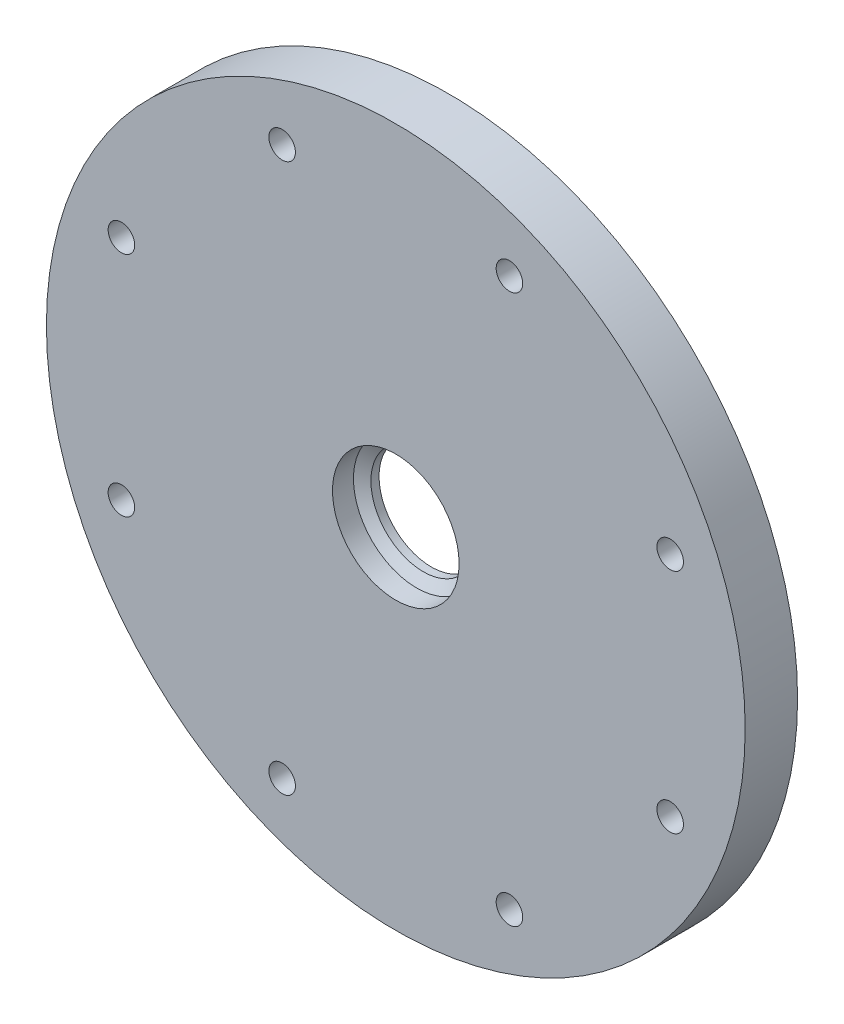
ISO-10303-21;
HEADER;
FILE_DESCRIPTION(('STEP AP214'),'2;1');
FILE_NAME('part.step','',(''),(''),'','','');
FILE_SCHEMA(('AUTOMOTIVE_DESIGN { 1 0 10303 214 1 1 1 1 }'));
ENDSEC;
DATA;
#1=APPLICATION_CONTEXT('core data for automotive mechanical design processes');
#2=APPLICATION_PROTOCOL_DEFINITION('international standard','automotive_design',2000,#1);
#3=PRODUCT_CONTEXT('',#1,'mechanical');
#4=PRODUCT('Part','Part','',(#3));
#5=PRODUCT_RELATED_PRODUCT_CATEGORY('part','',(#4));
#6=PRODUCT_DEFINITION_FORMATION('','',#4);
#7=PRODUCT_DEFINITION_CONTEXT('part definition',#1,'design');
#8=PRODUCT_DEFINITION('design','',#6,#7);
#9=PRODUCT_DEFINITION_SHAPE('','',#8);
#10=(LENGTH_UNIT() NAMED_UNIT(*) SI_UNIT(.MILLI.,.METRE.));
#11=(NAMED_UNIT(*) PLANE_ANGLE_UNIT() SI_UNIT($,.RADIAN.));
#12=(NAMED_UNIT(*) SI_UNIT($,.STERADIAN.) SOLID_ANGLE_UNIT());
#13=UNCERTAINTY_MEASURE_WITH_UNIT(LENGTH_MEASURE(1.E-05),#10,'distance_accuracy_value','');
#14=(GEOMETRIC_REPRESENTATION_CONTEXT(3) GLOBAL_UNCERTAINTY_ASSIGNED_CONTEXT((#13)) GLOBAL_UNIT_ASSIGNED_CONTEXT((#10,
#11,#12)) REPRESENTATION_CONTEXT('',''));
#15=CARTESIAN_POINT('',(0.,0.,0.));
#16=DIRECTION('',(0.,0.,1.));
#17=DIRECTION('',(1.,0.,0.));
#18=AXIS2_PLACEMENT_3D('',#15,#16,#17);
#19=CARTESIAN_POINT('',(0.,0.,9.525));
#20=DIRECTION('',(0.,0.,-1.));
#21=DIRECTION('',(-1.,0.,0.));
#22=AXIS2_PLACEMENT_3D('',#19,#20,#21);
#23=CYLINDRICAL_SURFACE('',#22,9.525);
#24=CARTESIAN_POINT('',(0.,0.,4.5245749415826));
#25=DIRECTION('',(0.,0.,1.));
#26=DIRECTION('',(1.,0.,0.));
#27=AXIS2_PLACEMENT_3D('',#24,#25,#26);
#28=CIRCLE('',#27,9.525);
#29=CARTESIAN_POINT('',(9.525,0.,4.5245749415826));
#30=VERTEX_POINT('',#29);
#31=EDGE_CURVE('E41',#30,#30,#28,.F.);
#32=ORIENTED_EDGE('',*,*,#31,.F.);
#33=EDGE_LOOP('',(#32));
#34=FACE_BOUND('',#33,.T.);
#35=CARTESIAN_POINT('',(0.,0.,3.048));
#36=DIRECTION('',(0.,0.,-1.));
#37=DIRECTION('',(-1.,0.,0.));
#38=AXIS2_PLACEMENT_3D('',#35,#36,#37);
#39=CIRCLE('',#38,9.525);
#40=CARTESIAN_POINT('',(-9.525,0.,3.048));
#41=VERTEX_POINT('',#40);
#42=EDGE_CURVE('E181',#41,#41,#39,.T.);
#43=ORIENTED_EDGE('',*,*,#42,.T.);
#44=EDGE_LOOP('',(#43));
#45=FACE_BOUND('',#44,.T.);
#46=ADVANCED_FACE('F38',(#34,#45),#23,.F.);
#47=CARTESIAN_POINT('',(0.,0.,9.525));
#48=DIRECTION('',(0.,0.,-1.));
#49=DIRECTION('',(-1.,0.,0.));
#50=AXIS2_PLACEMENT_3D('',#47,#48,#49);
#51=CYLINDRICAL_SURFACE('',#50,63.5);
#52=CARTESIAN_POINT('',(0.,0.,9.525));
#53=DIRECTION('',(0.,0.,1.));
#54=DIRECTION('',(1.,0.,0.));
#55=AXIS2_PLACEMENT_3D('',#52,#53,#54);
#56=CIRCLE('',#55,63.5);
#57=CARTESIAN_POINT('',(63.5,0.,9.525));
#58=VERTEX_POINT('',#57);
#59=EDGE_CURVE('E11',#58,#58,#56,.T.);
#60=ORIENTED_EDGE('',*,*,#59,.F.);
#61=EDGE_LOOP('',(#60));
#62=FACE_BOUND('',#61,.T.);
#63=CARTESIAN_POINT('',(0.,0.,0.));
#64=DIRECTION('',(0.,0.,1.));
#65=DIRECTION('',(1.,0.,0.));
#66=AXIS2_PLACEMENT_3D('',#63,#64,#65);
#67=CIRCLE('',#66,63.5);
#68=CARTESIAN_POINT('',(63.5,0.,0.));
#69=VERTEX_POINT('',#68);
#70=EDGE_CURVE('E46',#69,#69,#67,.T.);
#71=ORIENTED_EDGE('',*,*,#70,.T.);
#72=EDGE_LOOP('',(#71));
#73=FACE_BOUND('',#72,.T.);
#74=ADVANCED_FACE('F160',(#62,#73),#51,.T.);
#75=CARTESIAN_POINT('',(0.,0.,9.525));
#76=DIRECTION('',(0.,0.,1.));
#77=DIRECTION('',(1.,0.,0.));
#78=AXIS2_PLACEMENT_3D('',#75,#76,#77);
#79=PLANE('',#78);
#80=CARTESIAN_POINT('',(0.,0.,9.525));
#81=DIRECTION('',(0.,0.,1.));
#82=DIRECTION('',(1.,0.,0.));
#83=AXIS2_PLACEMENT_3D('',#80,#81,#82);
#84=CIRCLE('',#83,11.5062);
#85=CARTESIAN_POINT('',(11.5062,0.,9.525));
#86=VERTEX_POINT('',#85);
#87=EDGE_CURVE('E198',#86,#86,#84,.T.);
#88=ORIENTED_EDGE('',*,*,#87,.F.);
#89=EDGE_LOOP('',(#88));
#90=FACE_BOUND('',#89,.T.);
#91=CARTESIAN_POINT('',(49.866397767297,-20.6553382619051,9.525));
#92=DIRECTION('',(0.,0.,1.));
#93=DIRECTION('',(0.707106781186556,-0.707106781186539,0.));
#94=AXIS2_PLACEMENT_3D('',#91,#92,#93);
#95=CIRCLE('',#94,2.413);
#96=CARTESIAN_POINT('',(51.5726464303001,-22.3615869249082,9.525));
#97=VERTEX_POINT('',#96);
#98=EDGE_CURVE('E207',#97,#97,#95,.T.);
#99=ORIENTED_EDGE('',*,*,#98,.F.);
#100=EDGE_LOOP('',(#99));
#101=FACE_BOUND('',#100,.T.);
#102=CARTESIAN_POINT('',(20.6553382619063,-49.8663977672965,9.525));
#103=DIRECTION('',(0.,0.,1.));
#104=DIRECTION('',(0.,-1.,0.));
#105=AXIS2_PLACEMENT_3D('',#102,#103,#104);
#106=CIRCLE('',#105,2.413);
#107=CARTESIAN_POINT('',(20.6553382619063,-52.2793977672965,9.525));
#108=VERTEX_POINT('',#107);
#109=EDGE_CURVE('E211',#108,#108,#106,.T.);
#110=ORIENTED_EDGE('',*,*,#109,.F.);
#111=EDGE_LOOP('',(#110));
#112=FACE_BOUND('',#111,.T.);
#113=CARTESIAN_POINT('',(-20.6553382619053,-49.8663977672969,9.525));
#114=DIRECTION('',(0.,0.,1.));
#115=DIRECTION('',(-0.707106781186541,-0.707106781186554,0.));
#116=AXIS2_PLACEMENT_3D('',#113,#114,#115);
#117=CIRCLE('',#116,2.413);
#118=CARTESIAN_POINT('',(-22.3615869249084,-51.5726464303,9.525));
#119=VERTEX_POINT('',#118);
#120=EDGE_CURVE('E215',#119,#119,#117,.T.);
#121=ORIENTED_EDGE('',*,*,#120,.F.);
#122=EDGE_LOOP('',(#121));
#123=FACE_BOUND('',#122,.T.);
#124=CARTESIAN_POINT('',(-49.8663977672967,-20.6553382619058,9.525));
#125=DIRECTION('',(0.,0.,1.));
#126=DIRECTION('',(-1.,0.,0.));
#127=AXIS2_PLACEMENT_3D('',#124,#125,#126);
#128=CIRCLE('',#127,2.413);
#129=CARTESIAN_POINT('',(-52.2793977672967,-20.6553382619058,9.525));
#130=VERTEX_POINT('',#129);
#131=EDGE_CURVE('E219',#130,#130,#128,.T.);
#132=ORIENTED_EDGE('',*,*,#131,.F.);
#133=EDGE_LOOP('',(#132));
#134=FACE_BOUND('',#133,.T.);
#135=CARTESIAN_POINT('',(-49.8663977672968,20.6553382619054,9.525));
#136=DIRECTION('',(0.,0.,1.));
#137=DIRECTION('',(-0.707106781186551,0.707106781186544,0.));
#138=AXIS2_PLACEMENT_3D('',#135,#136,#137);
#139=CIRCLE('',#138,2.413);
#140=CARTESIAN_POINT('',(-51.5726464303,22.3615869249086,9.525));
#141=VERTEX_POINT('',#140);
#142=EDGE_CURVE('E223',#141,#141,#139,.T.);
#143=ORIENTED_EDGE('',*,*,#142,.F.);
#144=EDGE_LOOP('',(#143));
#145=FACE_BOUND('',#144,.T.);
#146=CARTESIAN_POINT('',(-20.6553382619059,49.8663977672966,9.525));
#147=DIRECTION('',(0.,0.,1.));
#148=DIRECTION('',(0.,1.,0.));
#149=AXIS2_PLACEMENT_3D('',#146,#147,#148);
#150=CIRCLE('',#149,2.413);
#151=CARTESIAN_POINT('',(-20.6553382619059,52.2793977672966,9.525));
#152=VERTEX_POINT('',#151);
#153=EDGE_CURVE('E227',#152,#152,#150,.T.);
#154=ORIENTED_EDGE('',*,*,#153,.F.);
#155=EDGE_LOOP('',(#154));
#156=FACE_BOUND('',#155,.T.);
#157=CARTESIAN_POINT('',(20.6553382619056,49.8663977672968,9.525));
#158=DIRECTION('',(0.,0.,1.));
#159=DIRECTION('',(0.707106781186546,0.707106781186549,0.));
#160=AXIS2_PLACEMENT_3D('',#157,#158,#159);
#161=CIRCLE('',#160,2.413);
#162=CARTESIAN_POINT('',(22.3615869249087,51.5726464302999,9.525));
#163=VERTEX_POINT('',#162);
#164=EDGE_CURVE('E231',#163,#163,#161,.T.);
#165=ORIENTED_EDGE('',*,*,#164,.F.);
#166=EDGE_LOOP('',(#165));
#167=FACE_BOUND('',#166,.T.);
#168=CARTESIAN_POINT('',(49.8663977672967,20.6553382619058,9.525));
#169=DIRECTION('',(0.,0.,1.));
#170=DIRECTION('',(1.,0.,0.));
#171=AXIS2_PLACEMENT_3D('',#168,#169,#170);
#172=CIRCLE('',#171,2.413);
#173=CARTESIAN_POINT('',(52.2793977672967,20.6553382619058,9.525));
#174=VERTEX_POINT('',#173);
#175=EDGE_CURVE('E178',#174,#174,#172,.T.);
#176=ORIENTED_EDGE('',*,*,#175,.F.);
#177=EDGE_LOOP('',(#176));
#178=FACE_BOUND('',#177,.T.);
#179=ORIENTED_EDGE('',*,*,#59,.T.);
#180=EDGE_LOOP('',(#179));
#181=FACE_BOUND('',#180,.T.);
#182=ADVANCED_FACE('F157',(#90,#101,#112,#123,#134,#145,#156,#167,#178,#181),#79,.T.);
#183=CARTESIAN_POINT('',(0.,0.,0.));
#184=DIRECTION('',(0.,0.,1.));
#185=DIRECTION('',(1.,0.,0.));
#186=AXIS2_PLACEMENT_3D('',#183,#184,#185);
#187=PLANE('',#186);
#188=DIRECTION('',(-1.,0.,0.));
#189=VECTOR('',#188,1.);
#190=CARTESIAN_POINT('',(0.,3.30820588766945,0.));
#191=LINE('',#190,#189);
#192=CARTESIAN_POINT('',(41.7265377302756,3.30820588766945,0.));
#193=VERTEX_POINT('',#192);
#194=CARTESIAN_POINT('',(38.3776456322172,3.30820588766945,0.));
#195=VERTEX_POINT('',#194);
#196=EDGE_CURVE('E104',#193,#195,#191,.T.);
#197=ORIENTED_EDGE('',*,*,#196,.T.);
#198=CARTESIAN_POINT('',(38.3776456322171,7.88179807913385,0.));
#199=DIRECTION('',(0.,0.,1.));
#200=DIRECTION('',(1.,0.,0.));
#201=AXIS2_PLACEMENT_3D('',#198,#199,#200);
#202=CIRCLE('',#201,4.57359219146441);
#203=CARTESIAN_POINT('',(33.8651421831309,7.13677582724513,0.));
#204=VERTEX_POINT('',#203);
#205=EDGE_CURVE('E183',#195,#204,#202,.F.);
#206=ORIENTED_EDGE('',*,*,#205,.T.);
#207=CARTESIAN_POINT('',(34.2958656322172,0.,0.));
#208=CARTESIAN_POINT('',(34.2988283398987,0.0719164356410514,0.));
#209=CARTESIAN_POINT('',(34.3047545772634,0.215769260101811,0.));
#210=CARTESIAN_POINT('',(34.3119668879308,0.431642323746638,0.));
#211=CARTESIAN_POINT('',(34.3179347547378,0.647612083143586,0.));
#212=CARTESIAN_POINT('',(34.3271399883812,1.07991711399044,0.));
#213=CARTESIAN_POINT('',(34.3329421657517,2.09030657601597,0.));
#214=CARTESIAN_POINT('',(34.2798982254852,3.60736205399581,0.));
#215=CARTESIAN_POINT('',(34.1204451546237,5.41030124969768,0.));
#216=CARTESIAN_POINT('',(33.8801694761154,7.13532662840969,0.));
#217=CARTESIAN_POINT('',(33.5528859624341,8.8499256844614,0.));
#218=CARTESIAN_POINT('',(33.1389978044588,10.5497094295948,0.));
#219=CARTESIAN_POINT('',(32.6391403513611,12.2303025190622,0.));
#220=CARTESIAN_POINT('',(32.0541748945098,13.887355712914,0.));
#221=CARTESIAN_POINT('',(31.3851870558513,15.5165575032151,0.));
#222=CARTESIAN_POINT('',(30.6334836447529,17.113645750915,0.));
#223=CARTESIAN_POINT('',(29.8005899514624,18.6744190548477,0.));
#224=CARTESIAN_POINT('',(28.8882464002713,20.1947479877455,0.));
#225=CARTESIAN_POINT('',(27.8984048753274,21.6705861384519,0.));
#226=CARTESIAN_POINT('',(26.8332245214539,23.0979809668407,0.));
#227=CARTESIAN_POINT('',(25.6950670671234,24.4730844426948,0.));
#228=CARTESIAN_POINT('',(24.4864916349468,25.7921634500981,0.));
#229=CARTESIAN_POINT('',(23.2102490508359,27.0516099322624,0.));
#230=CARTESIAN_POINT('',(21.8692756520975,28.2479507532477,0.));
#231=CARTESIAN_POINT('',(20.4666866048744,29.3778572518646,0.));
#232=CARTESIAN_POINT('',(19.0057687415094,30.43815446357,0.));
#233=CARTESIAN_POINT('',(17.4899729317966,31.425829986316,0.));
#234=CARTESIAN_POINT('',(15.9229060035758,32.3380424668578,0.));
#235=CARTESIAN_POINT('',(14.3083222300884,33.172129684753,0.));
#236=CARTESIAN_POINT('',(12.6501144028526,33.9256162118566,0.));
#237=CARTESIAN_POINT('',(10.9523045104309,34.5962206262852,0.));
#238=CARTESIAN_POINT('',(9.2190340445245,35.1818622604019,0.));
#239=CARTESIAN_POINT('',(7.45455395624005,35.6806674637987,0.));
#240=CARTESIAN_POINT('',(5.663214286303,36.0909753630028,0.));
#241=CARTESIAN_POINT('',(3.84945349415193,36.4113431010872,0.));
#242=CARTESIAN_POINT('',(2.0177875117066,36.6405505413982,0.));
#243=CARTESIAN_POINT('',(0.172798548525801,36.777604420956,0.));
#244=CARTESIAN_POINT('',(-1.68087632413851,36.8217419404773,0.));
#245=CARTESIAN_POINT('',(-3.53855678217463,36.7724337792443,0.));
#246=CARTESIAN_POINT('',(-5.395531021451,36.6293865244745,0.));
#247=CARTESIAN_POINT('',(-7.24706766521656,36.3925445063906,0.));
#248=CARTESIAN_POINT('',(-9.08842777610979,36.0620910314903,0.));
#249=CARTESIAN_POINT('',(-10.9148769424333,35.638449008293,0.));
#250=CARTESIAN_POINT('',(-12.7216974079583,35.1222809610018,0.));
#251=CARTESIAN_POINT('',(-14.504200214338,34.5144884285037,0.));
#252=CARTESIAN_POINT('',(-16.2577373249457,33.8162107472913,0.));
#253=CARTESIAN_POINT('',(-17.9777136989338,33.0288232187894,0.));
#254=CARTESIAN_POINT('',(-19.6595992842238,32.1539346629252,0.));
#255=CARTESIAN_POINT('',(-21.2989408982579,31.1933843615357,0.));
#256=CARTESIAN_POINT('',(-22.8913739654388,30.1492383966572,0.));
#257=CARTESIAN_POINT('',(-24.4326340804494,29.0237853904367,0.));
#258=CARTESIAN_POINT('',(-25.9185683669347,27.8195316549019,0.));
#259=CARTESIAN_POINT('',(-27.3451466014136,26.5391957614133,0.));
#260=CARTESIAN_POINT('',(-28.7084720727539,25.1857025411449,0.));
#261=CARTESIAN_POINT('',(-30.0047921481285,23.7621765294992,0.));
#262=CARTESIAN_POINT('',(-31.230508516913,22.2719348687727,0.));
#263=CARTESIAN_POINT('',(-32.3821870848105,20.7184796849594,0.));
#264=CARTESIAN_POINT('',(-33.4565674911139,19.1054899558742,0.));
#265=CARTESIAN_POINT('',(-34.4505722230281,17.4368128893039,0.));
#266=CARTESIAN_POINT('',(-35.361315301739,15.7164548311081,0.));
#267=CARTESIAN_POINT('',(-36.1861105160575,13.9485717246141,0.));
#268=CARTESIAN_POINT('',(-36.9224791803928,12.1374591437956,0.));
#269=CARTESIAN_POINT('',(-37.5681573950165,10.2875419239972,0.));
#270=CARTESIAN_POINT('',(-38.1211027877574,8.40336341507815,0.));
#271=CARTESIAN_POINT('',(-38.579500717431,6.48957438292442,0.));
#272=CARTESIAN_POINT('',(-38.9417699207588,4.55092158633372,0.));
#273=CARTESIAN_POINT('',(-39.2065675857196,2.59223605718916,0.));
#274=CARTESIAN_POINT('',(-39.3727938357768,0.618421112757694,0.));
#275=CARTESIAN_POINT('',(-39.4395956108992,-1.36555987023922,0.));
#276=CARTESIAN_POINT('',(-39.406369932679,-3.35469588940579,0.));
#277=CARTESIAN_POINT('',(-39.2727665424726,-5.34394092724165,0.));
#278=CARTESIAN_POINT('',(-39.0386899030474,-7.32822670685141,0.));
#279=CARTESIAN_POINT('',(-38.7043005557691,-9.30247556063955,0.));
#280=CARTESIAN_POINT('',(-38.2700158270333,-11.2616133793943,0.));
#281=CARTESIAN_POINT('',(-37.7365098792967,-13.2005826088241,0.));
#282=CARTESIAN_POINT('',(-37.1047131036853,-15.1143552603352,0.));
#283=CARTESIAN_POINT('',(-36.3758108529087,-16.9979459026719,0.));
#284=CARTESIAN_POINT('',(-35.5512415148377,-18.846424600921,0.));
#285=CARTESIAN_POINT('',(-34.6326939288693,-20.6549297694151,0.));
#286=CARTESIAN_POINT('',(-33.6221041488316,-22.4186809050873,0.));
#287=CARTESIAN_POINT('',(-32.5216515579523,-24.1329911680554,0.));
#288=CARTESIAN_POINT('',(-31.333754343067,-25.793279776417,0.));
#289=CARTESIAN_POINT('',(-30.0610643369273,-27.395084182599,0.));
#290=CARTESIAN_POINT('',(-28.7064612391545,-28.9340719990193,0.));
#291=CARTESIAN_POINT('',(-27.2730462280158,-30.4060526413252,0.));
#292=CARTESIAN_POINT('',(-25.7641349768275,-31.8069886580736,0.));
#293=CARTESIAN_POINT('',(-24.1832500903733,-33.1330067163735,0.));
#294=CARTESIAN_POINT('',(-22.5341129783108,-34.3804082137974,0.));
#295=CARTESIAN_POINT('',(-20.820635184016,-35.5456794876579,0.));
#296=CARTESIAN_POINT('',(-19.0469091888745,-36.6255015937423,0.));
#297=CARTESIAN_POINT('',(-17.2171987133532,-37.616759627458,0.));
#298=CARTESIAN_POINT('',(-15.3359285377066,-38.5165515615768,0.));
#299=CARTESIAN_POINT('',(-13.4076738663693,-39.3221965757118,0.));
#300=CARTESIAN_POINT('',(-11.4371492614876,-40.0312428540429,0.));
#301=CARTESIAN_POINT('',(-9.42919717216959,-40.6414748289538,0.));
#302=CARTESIAN_POINT('',(-7.38877608722696,-41.1509198496055,0.));
#303=CARTESIAN_POINT('',(-5.32094834028347,-41.5578542559499,0.));
#304=CARTESIAN_POINT('',(-3.23086759708489,-41.8608088399455,0.));
#305=CARTESIAN_POINT('',(-1.12376605586641,-42.058573677502,0.));
#306=CARTESIAN_POINT('',(0.995058607571763,-42.1502023159327,0.));
#307=CARTESIAN_POINT('',(3.1202565175867,-42.1350153036167,0.));
#308=CARTESIAN_POINT('',(5.24643906603381,-42.012603049844,0.));
#309=CARTESIAN_POINT('',(7.36819253542281,-41.7828280049013,0.));
#310=CARTESIAN_POINT('',(9.48009184352148,-41.4458261517547,0.));
#311=CARTESIAN_POINT('',(11.5767143746119,-41.0020078027653,0.));
#312=CARTESIAN_POINT('',(13.6526538622118,-40.4520576963991,0.));
#313=CARTESIAN_POINT('',(15.7025342878154,-39.7969343908391,0.));
#314=CARTESIAN_POINT('',(17.7210237599909,-39.0378689530399,0.));
#315=CARTESIAN_POINT('',(19.7028483381266,-38.1763629437867,0.));
#316=CARTESIAN_POINT('',(21.6428057650362,-37.2141857008853,0.));
#317=CARTESIAN_POINT('',(23.5357790728052,-36.153370924662,0.));
#318=CARTESIAN_POINT('',(25.376750026369,-34.9962125715943,0.));
#319=CARTESIAN_POINT('',(27.1608123696351,-33.7452600637943,0.));
#320=CARTESIAN_POINT('',(28.8831848392854,-32.4033128238131,0.));
#321=CARTESIAN_POINT('',(30.5392239118853,-30.9734141460373,0.));
#322=CARTESIAN_POINT('',(32.1244362504616,-29.458844417699,0.));
#323=CARTESIAN_POINT('',(33.6344908172952,-27.8631137042031,0.));
#324=CARTESIAN_POINT('',(35.0652306205303,-26.1899537152836,0.));
#325=CARTESIAN_POINT('',(36.4126840628171,-24.4433091700016,0.));
#326=CARTESIAN_POINT('',(37.6730758613159,-22.6273285803872,0.));
#327=CARTESIAN_POINT('',(38.8428375091632,-20.7463544749617,0.));
#328=CARTESIAN_POINT('',(39.9186172497505,-18.8049130850149,0.));
#329=CARTESIAN_POINT('',(40.897289536131,-16.8077035179059,0.));
#330=CARTESIAN_POINT('',(41.7759639492164,-14.7595864431264,0.));
#331=CARTESIAN_POINT('',(42.5519935496357,-12.6655723182052,0.));
#332=CARTESIAN_POINT('',(43.2229826395127,-10.5308091828219,0.));
#333=CARTESIAN_POINT('',(43.7867939118442,-8.36057005073488,0.));
#334=CARTESIAN_POINT('',(44.2415549666095,-6.1602399302733,0.));
#335=CARTESIAN_POINT('',(44.5712845422953,-4.02827816749163,0.));
#336=CARTESIAN_POINT('',(44.7405602674272,-2.44084571238201,0.));
#337=CARTESIAN_POINT('',(44.8137280393605,-1.50376068035805,0.));
#338=CARTESIAN_POINT('',(44.8394775213742,-1.12829322602927,0.));
#339=CARTESIAN_POINT('',(44.8570322264384,-0.84647024133921,0.));
#340=CARTESIAN_POINT('',(44.8727821790452,-0.564469794978507,0.));
#341=CARTESIAN_POINT('',(44.8868875760611,-0.282309502735571,0.));
#342=CARTESIAN_POINT('',(44.8947903255209,-0.094111086056059,0.));
#343=CARTESIAN_POINT('',(44.8987421990149,0.,0.));
#344=B_SPLINE_CURVE_WITH_KNOTS('',3,(#207,#208,#209,#210,#211,#212,#213,#214,#215,#216,#217,
#218,#219,#220,#221,#222,#223,#224,#225,#226,#227,#228,#229,#230,#231,#232,#233,#234,#235,#236,
#237,#238,#239,#240,#241,#242,#243,#244,#245,#246,#247,#248,#249,#250,#251,#252,#253,#254,#255,
#256,#257,#258,#259,#260,#261,#262,#263,#264,#265,#266,#267,#268,#269,#270,#271,#272,#273,#274,
#275,#276,#277,#278,#279,#280,#281,#282,#283,#284,#285,#286,#287,#288,#289,#290,#291,#292,#293,
#294,#295,#296,#297,#298,#299,#300,#301,#302,#303,#304,#305,#306,#307,#308,#309,#310,#311,#312,
#313,#314,#315,#316,#317,#318,#319,#320,#321,#322,#323,#324,#325,#326,#327,#328,#329,#330,#331,
#332,#333,#334,#335,#336,#337,#338,#339,#340,#341,#342,#343),.UNSPECIFIED.,.F.,.F.,(4,1,1,1,1,1,
1,1,1,1,1,1,1,1,1,1,1,1,1,1,1,1,1,1,1,1,1,1,1,1,1,1,1,1,1,1,1,1,1,1,1,1,1,1,1,1,1,1,1,1,1,1,1,1,
1,1,1,1,1,1,1,1,1,1,1,1,1,1,1,1,1,1,1,1,1,1,1,1,1,1,1,1,1,1,1,1,1,1,1,1,1,1,1,1,1,1,1,1,1,1,1,1,
1,1,1,1,1,1,1,1,1,1,1,1,1,1,1,1,1,1,1,1,1,1,1,1,1,1,1,1,1,1,1,1,4),(0.,0.000870247599430737,
0.00174073664861733,0.00261146583389978,0.00348243493817679,0.00696871163036565,
0.0148269159676711,0.0218284300658471,0.0288454978901986,0.0358781861529964,0.0429265557930998,
0.0499906632180707,0.0570705611878874,0.0641662994541098,0.071277925235676,0.0784054835829576,
0.0855490176630983,0.0927085689883016,0.0998841776017372,0.107075882231238,0.11428372041806,
0.121507728626011,0.128747942334863,0.13600439612105,0.143277123727941,0.150566158127471,
0.157871531574549,0.165193275655374,0.172531421330565,0.179885998973864,0.187257038407004,
0.194644568931274,0.202048619356179,0.209469218025581,0.216906392841596,0.224360171286527,
0.231830580443038,0.239317647012768,0.246821397333545,0.254341857395345,0.261879052855118,
0.269433009050593,0.277003751013156,0.284591303479885,0.292195690904824,0.299816937469546,
0.307455067093091,0.315110103441297,0.32278206993561,0.330470989761382,0.33817688587572,
0.345899781014901,0.353639697701409,0.361396658250587,0.369170684776971,0.376961799200297,
0.384770023251215,0.392595378476738,0.400437886245424,0.408297567752328,0.41617444402372,
0.424068535921609,0.431979864148049,0.439908449249276,0.447854311619665,0.455817471505519,
0.463797949008711,0.47179576409017,0.479810936573239,0.487843486146895,0.495893432368847,
0.503960794668521,0.512045592349928,0.520147844594431,0.528267570463411,0.536404788900837,
0.544559518735747,0.552731778684641,0.560921587353796,0.5691289632415,0.57735392474021,
0.585596490138645,0.593856677623807,0.602134505282936,0.610429991105407,0.618743152984567,
0.627074008719514,0.635422576016818,0.643788872492204,0.652172915672168,0.660574722995556,
0.668994311815095,0.677431699398876,0.685886902931806,0.694359939517004,0.702850826177169,
0.711359579855908,0.719886217419028,0.72843075565579,0.736993211280136,0.745573600931878,
0.754171941177858,0.76278824851308,0.771422539361813,0.780074830078659,0.788745136949606,
0.797433476193047,0.806139863960776,0.814864316338961,0.823606849349089,0.8323674789489,
0.84114622103328,0.849943091435156,0.858758105926351,0.867591280218428,0.876442629963517,
0.885312170755117,0.894199918128888,0.903105887563412,0.912030094480956,0.920972554248204,
0.929933282176977,0.938912293524941,0.947909603496297,0.956925227242455,0.965959179862699,
0.975011476404832,0.984082131865813,0.992034027196134,0.99430858251311,0.99544629118736,
0.996584287244162,0.997722570712535,0.998861141621482,1.),.UNSPECIFIED.);
#345=CARTESIAN_POINT('',(44.8987421990149,0.,0.));
#346=VERTEX_POINT('',#345);
#347=EDGE_CURVE('E188',#204,#346,#344,.T.);
#348=ORIENTED_EDGE('',*,*,#347,.T.);
#349=CARTESIAN_POINT('',(41.7265377302756,0.133205887669454,0.));
#350=DIRECTION('',(0.,0.,1.));
#351=DIRECTION('',(1.,0.,0.));
#352=AXIS2_PLACEMENT_3D('',#349,#350,#351);
#353=CIRCLE('',#352,3.175);
#354=EDGE_CURVE('E54',#346,#193,#353,.T.);
#355=ORIENTED_EDGE('',*,*,#354,.T.);
#356=EDGE_LOOP('',(#197,#206,#348,#355));
#357=FACE_BOUND('',#356,.T.);
#358=CARTESIAN_POINT('',(49.866397767297,-20.6553382619051,0.));
#359=DIRECTION('',(0.,0.,1.));
#360=DIRECTION('',(0.707106781186556,-0.707106781186539,0.));
#361=AXIS2_PLACEMENT_3D('',#358,#359,#360);
#362=CIRCLE('',#361,2.413);
#363=CARTESIAN_POINT('',(51.5726464303001,-22.3615869249082,0.));
#364=VERTEX_POINT('',#363);
#365=EDGE_CURVE('E243',#364,#364,#362,.T.);
#366=ORIENTED_EDGE('',*,*,#365,.T.);
#367=EDGE_LOOP('',(#366));
#368=FACE_BOUND('',#367,.T.);
#369=CARTESIAN_POINT('',(20.6553382619063,-49.8663977672965,0.));
#370=DIRECTION('',(0.,0.,1.));
#371=DIRECTION('',(0.,-1.,0.));
#372=AXIS2_PLACEMENT_3D('',#369,#370,#371);
#373=CIRCLE('',#372,2.413);
#374=CARTESIAN_POINT('',(20.6553382619063,-52.2793977672965,0.));
#375=VERTEX_POINT('',#374);
#376=EDGE_CURVE('E247',#375,#375,#373,.T.);
#377=ORIENTED_EDGE('',*,*,#376,.T.);
#378=EDGE_LOOP('',(#377));
#379=FACE_BOUND('',#378,.T.);
#380=CARTESIAN_POINT('',(-20.6553382619053,-49.8663977672969,0.));
#381=DIRECTION('',(0.,0.,1.));
#382=DIRECTION('',(-0.707106781186541,-0.707106781186554,0.));
#383=AXIS2_PLACEMENT_3D('',#380,#381,#382);
#384=CIRCLE('',#383,2.413);
#385=CARTESIAN_POINT('',(-22.3615869249084,-51.5726464303,0.));
#386=VERTEX_POINT('',#385);
#387=EDGE_CURVE('E251',#386,#386,#384,.T.);
#388=ORIENTED_EDGE('',*,*,#387,.T.);
#389=EDGE_LOOP('',(#388));
#390=FACE_BOUND('',#389,.T.);
#391=CARTESIAN_POINT('',(-49.8663977672967,-20.6553382619058,0.));
#392=DIRECTION('',(0.,0.,1.));
#393=DIRECTION('',(-1.,0.,0.));
#394=AXIS2_PLACEMENT_3D('',#391,#392,#393);
#395=CIRCLE('',#394,2.413);
#396=CARTESIAN_POINT('',(-52.2793977672967,-20.6553382619058,0.));
#397=VERTEX_POINT('',#396);
#398=EDGE_CURVE('E255',#397,#397,#395,.T.);
#399=ORIENTED_EDGE('',*,*,#398,.T.);
#400=EDGE_LOOP('',(#399));
#401=FACE_BOUND('',#400,.T.);
#402=CARTESIAN_POINT('',(-49.8663977672968,20.6553382619054,0.));
#403=DIRECTION('',(0.,0.,1.));
#404=DIRECTION('',(-0.707106781186551,0.707106781186544,0.));
#405=AXIS2_PLACEMENT_3D('',#402,#403,#404);
#406=CIRCLE('',#405,2.413);
#407=CARTESIAN_POINT('',(-51.5726464303,22.3615869249086,0.));
#408=VERTEX_POINT('',#407);
#409=EDGE_CURVE('E259',#408,#408,#406,.T.);
#410=ORIENTED_EDGE('',*,*,#409,.T.);
#411=EDGE_LOOP('',(#410));
#412=FACE_BOUND('',#411,.T.);
#413=CARTESIAN_POINT('',(-20.6553382619059,49.8663977672966,0.));
#414=DIRECTION('',(0.,0.,1.));
#415=DIRECTION('',(0.,1.,0.));
#416=AXIS2_PLACEMENT_3D('',#413,#414,#415);
#417=CIRCLE('',#416,2.413);
#418=CARTESIAN_POINT('',(-20.6553382619059,52.2793977672966,0.));
#419=VERTEX_POINT('',#418);
#420=EDGE_CURVE('E240',#419,#419,#417,.T.);
#421=ORIENTED_EDGE('',*,*,#420,.T.);
#422=EDGE_LOOP('',(#421));
#423=FACE_BOUND('',#422,.T.);
#424=CARTESIAN_POINT('',(20.6553382619056,49.8663977672968,0.));
#425=DIRECTION('',(0.,0.,1.));
#426=DIRECTION('',(0.707106781186546,0.707106781186549,0.));
#427=AXIS2_PLACEMENT_3D('',#424,#425,#426);
#428=CIRCLE('',#427,2.413);
#429=CARTESIAN_POINT('',(22.3615869249087,51.5726464302999,0.));
#430=VERTEX_POINT('',#429);
#431=EDGE_CURVE('E236',#430,#430,#428,.T.);
#432=ORIENTED_EDGE('',*,*,#431,.T.);
#433=EDGE_LOOP('',(#432));
#434=FACE_BOUND('',#433,.T.);
#435=CARTESIAN_POINT('',(49.8663977672967,20.6553382619058,0.));
#436=DIRECTION('',(0.,0.,1.));
#437=DIRECTION('',(1.,0.,0.));
#438=AXIS2_PLACEMENT_3D('',#435,#436,#437);
#439=CIRCLE('',#438,2.413);
#440=CARTESIAN_POINT('',(52.2793977672967,20.6553382619058,0.));
#441=VERTEX_POINT('',#440);
#442=EDGE_CURVE('E175',#441,#441,#439,.T.);
#443=ORIENTED_EDGE('',*,*,#442,.T.);
#444=EDGE_LOOP('',(#443));
#445=FACE_BOUND('',#444,.T.);
#446=ORIENTED_EDGE('',*,*,#70,.F.);
#447=EDGE_LOOP('',(#446));
#448=FACE_BOUND('',#447,.T.);
#449=ADVANCED_FACE('F155',(#357,#368,#379,#390,#401,#412,#423,#434,#445,#448),#187,.F.);
#450=CARTESIAN_POINT('',(49.8663977672967,20.6553382619058,0.));
#451=DIRECTION('',(0.,0.,1.));
#452=DIRECTION('',(1.,0.,0.));
#453=AXIS2_PLACEMENT_3D('',#450,#451,#452);
#454=CYLINDRICAL_SURFACE('',#453,2.413);
#455=ORIENTED_EDGE('',*,*,#442,.F.);
#456=EDGE_LOOP('',(#455));
#457=FACE_BOUND('',#456,.T.);
#458=ORIENTED_EDGE('',*,*,#175,.T.);
#459=EDGE_LOOP('',(#458));
#460=FACE_BOUND('',#459,.T.);
#461=ADVANCED_FACE('F151',(#457,#460),#454,.F.);
#462=CARTESIAN_POINT('',(20.6553382619056,49.8663977672968,0.));
#463=DIRECTION('',(0.,0.,1.));
#464=DIRECTION('',(1.,0.,0.));
#465=AXIS2_PLACEMENT_3D('',#462,#463,#464);
#466=CYLINDRICAL_SURFACE('',#465,2.413);
#467=ORIENTED_EDGE('',*,*,#431,.F.);
#468=EDGE_LOOP('',(#467));
#469=FACE_BOUND('',#468,.T.);
#470=ORIENTED_EDGE('',*,*,#164,.T.);
#471=EDGE_LOOP('',(#470));
#472=FACE_BOUND('',#471,.T.);
#473=ADVANCED_FACE('F129',(#469,#472),#466,.F.);
#474=CARTESIAN_POINT('',(-20.6553382619059,49.8663977672966,0.));
#475=DIRECTION('',(0.,0.,1.));
#476=DIRECTION('',(1.,0.,0.));
#477=AXIS2_PLACEMENT_3D('',#474,#475,#476);
#478=CYLINDRICAL_SURFACE('',#477,2.413);
#479=ORIENTED_EDGE('',*,*,#420,.F.);
#480=EDGE_LOOP('',(#479));
#481=FACE_BOUND('',#480,.T.);
#482=ORIENTED_EDGE('',*,*,#153,.T.);
#483=EDGE_LOOP('',(#482));
#484=FACE_BOUND('',#483,.T.);
#485=ADVANCED_FACE('F125',(#481,#484),#478,.F.);
#486=CARTESIAN_POINT('',(-49.8663977672968,20.6553382619054,0.));
#487=DIRECTION('',(0.,0.,1.));
#488=DIRECTION('',(1.,0.,0.));
#489=AXIS2_PLACEMENT_3D('',#486,#487,#488);
#490=CYLINDRICAL_SURFACE('',#489,2.413);
#491=ORIENTED_EDGE('',*,*,#409,.F.);
#492=EDGE_LOOP('',(#491));
#493=FACE_BOUND('',#492,.T.);
#494=ORIENTED_EDGE('',*,*,#142,.T.);
#495=EDGE_LOOP('',(#494));
#496=FACE_BOUND('',#495,.T.);
#497=ADVANCED_FACE('F128',(#493,#496),#490,.F.);
#498=CARTESIAN_POINT('',(-49.8663977672967,-20.6553382619058,0.));
#499=DIRECTION('',(0.,0.,1.));
#500=DIRECTION('',(1.,0.,0.));
#501=AXIS2_PLACEMENT_3D('',#498,#499,#500);
#502=CYLINDRICAL_SURFACE('',#501,2.413);
#503=ORIENTED_EDGE('',*,*,#398,.F.);
#504=EDGE_LOOP('',(#503));
#505=FACE_BOUND('',#504,.T.);
#506=ORIENTED_EDGE('',*,*,#131,.T.);
#507=EDGE_LOOP('',(#506));
#508=FACE_BOUND('',#507,.T.);
#509=ADVANCED_FACE('F133',(#505,#508),#502,.F.);
#510=CARTESIAN_POINT('',(-20.6553382619053,-49.8663977672969,0.));
#511=DIRECTION('',(0.,0.,1.));
#512=DIRECTION('',(1.,0.,0.));
#513=AXIS2_PLACEMENT_3D('',#510,#511,#512);
#514=CYLINDRICAL_SURFACE('',#513,2.413);
#515=ORIENTED_EDGE('',*,*,#387,.F.);
#516=EDGE_LOOP('',(#515));
#517=FACE_BOUND('',#516,.T.);
#518=ORIENTED_EDGE('',*,*,#120,.T.);
#519=EDGE_LOOP('',(#518));
#520=FACE_BOUND('',#519,.T.);
#521=ADVANCED_FACE('F137',(#517,#520),#514,.F.);
#522=CARTESIAN_POINT('',(20.6553382619063,-49.8663977672965,0.));
#523=DIRECTION('',(0.,0.,1.));
#524=DIRECTION('',(1.,0.,0.));
#525=AXIS2_PLACEMENT_3D('',#522,#523,#524);
#526=CYLINDRICAL_SURFACE('',#525,2.413);
#527=ORIENTED_EDGE('',*,*,#376,.F.);
#528=EDGE_LOOP('',(#527));
#529=FACE_BOUND('',#528,.T.);
#530=ORIENTED_EDGE('',*,*,#109,.T.);
#531=EDGE_LOOP('',(#530));
#532=FACE_BOUND('',#531,.T.);
#533=ADVANCED_FACE('F141',(#529,#532),#526,.F.);
#534=CARTESIAN_POINT('',(49.866397767297,-20.6553382619051,0.));
#535=DIRECTION('',(0.,0.,1.));
#536=DIRECTION('',(1.,0.,0.));
#537=AXIS2_PLACEMENT_3D('',#534,#535,#536);
#538=CYLINDRICAL_SURFACE('',#537,2.413);
#539=ORIENTED_EDGE('',*,*,#365,.F.);
#540=EDGE_LOOP('',(#539));
#541=FACE_BOUND('',#540,.T.);
#542=ORIENTED_EDGE('',*,*,#98,.T.);
#543=EDGE_LOOP('',(#542));
#544=FACE_BOUND('',#543,.T.);
#545=ADVANCED_FACE('F124',(#541,#544),#538,.F.);
#546=CARTESIAN_POINT('',(38.3776456322171,7.88179807913385,-4.826));
#547=DIRECTION('',(0.,0.,1.));
#548=DIRECTION('',(1.,0.,0.));
#549=AXIS2_PLACEMENT_3D('',#546,#547,#548);
#550=CYLINDRICAL_SURFACE('',#549,4.57359219146441);
#551=ORIENTED_EDGE('',*,*,#205,.F.);
#552=DIRECTION('',(0.,0.,1.));
#553=VECTOR('',#552,1.);
#554=CARTESIAN_POINT('',(38.3776456322172,3.30820588766945,-4.826));
#555=LINE('',#554,#553);
#556=CARTESIAN_POINT('',(38.3776456322172,3.30820588766945,-4.826));
#557=VERTEX_POINT('',#556);
#558=EDGE_CURVE('E63',#557,#195,#555,.T.);
#559=ORIENTED_EDGE('',*,*,#558,.F.);
#560=CARTESIAN_POINT('',(38.3776456322171,7.88179807913385,-4.826));
#561=DIRECTION('',(0.,0.,1.));
#562=DIRECTION('',(1.,0.,0.));
#563=AXIS2_PLACEMENT_3D('',#560,#561,#562);
#564=CIRCLE('',#563,4.57359219146441);
#565=CARTESIAN_POINT('',(33.8651421831309,7.13677582724513,-4.826));
#566=VERTEX_POINT('',#565);
#567=EDGE_CURVE('E102',#557,#566,#564,.F.);
#568=ORIENTED_EDGE('',*,*,#567,.T.);
#569=DIRECTION('',(0.,0.,1.));
#570=VECTOR('',#569,1.);
#571=CARTESIAN_POINT('',(33.8651421831309,7.13677582724513,-4.826));
#572=LINE('',#571,#570);
#573=EDGE_CURVE('E84',#566,#204,#572,.T.);
#574=ORIENTED_EDGE('',*,*,#573,.T.);
#575=EDGE_LOOP('',(#551,#559,#568,#574));
#576=FACE_BOUND('',#575,.T.);
#577=ADVANCED_FACE('F120',(#576),#550,.F.);
#578=CARTESIAN_POINT('',(0.,3.30820588766945,-4.826));
#579=DIRECTION('',(0.,1.,0.));
#580=DIRECTION('',(-1.,0.,0.));
#581=AXIS2_PLACEMENT_3D('',#578,#579,#580);
#582=PLANE('',#581);
#583=ORIENTED_EDGE('',*,*,#196,.F.);
#584=DIRECTION('',(0.,0.,1.));
#585=VECTOR('',#584,1.);
#586=CARTESIAN_POINT('',(41.7265377302756,3.30820588766945,-4.826));
#587=LINE('',#586,#585);
#588=CARTESIAN_POINT('',(41.7265377302756,3.30820588766945,-4.826));
#589=VERTEX_POINT('',#588);
#590=EDGE_CURVE('E93',#589,#193,#587,.T.);
#591=ORIENTED_EDGE('',*,*,#590,.F.);
#592=DIRECTION('',(-1.,0.,0.));
#593=VECTOR('',#592,1.);
#594=CARTESIAN_POINT('',(0.,3.30820588766945,-4.826));
#595=LINE('',#594,#593);
#596=EDGE_CURVE('E99',#589,#557,#595,.T.);
#597=ORIENTED_EDGE('',*,*,#596,.T.);
#598=ORIENTED_EDGE('',*,*,#558,.T.);
#599=EDGE_LOOP('',(#583,#591,#597,#598));
#600=FACE_BOUND('',#599,.T.);
#601=ADVANCED_FACE('F123',(#600),#582,.T.);
#602=CARTESIAN_POINT('',(41.7265377302756,0.133205887669454,-4.826));
#603=DIRECTION('',(0.,0.,1.));
#604=DIRECTION('',(1.,0.,0.));
#605=AXIS2_PLACEMENT_3D('',#602,#603,#604);
#606=CYLINDRICAL_SURFACE('',#605,3.175);
#607=ORIENTED_EDGE('',*,*,#354,.F.);
#608=DIRECTION('',(0.,0.,1.));
#609=VECTOR('',#608,1.);
#610=CARTESIAN_POINT('',(44.8987421990149,0.,-4.826));
#611=LINE('',#610,#609);
#612=CARTESIAN_POINT('',(44.8987421990149,0.,-4.826));
#613=VERTEX_POINT('',#612);
#614=EDGE_CURVE('E87',#613,#346,#611,.T.);
#615=ORIENTED_EDGE('',*,*,#614,.F.);
#616=CARTESIAN_POINT('',(41.7265377302756,0.133205887669454,-4.826));
#617=DIRECTION('',(0.,0.,1.));
#618=DIRECTION('',(1.,0.,0.));
#619=AXIS2_PLACEMENT_3D('',#616,#617,#618);
#620=CIRCLE('',#619,3.175);
#621=EDGE_CURVE('E90',#613,#589,#620,.T.);
#622=ORIENTED_EDGE('',*,*,#621,.T.);
#623=ORIENTED_EDGE('',*,*,#590,.T.);
#624=EDGE_LOOP('',(#607,#615,#622,#623));
#625=FACE_BOUND('',#624,.T.);
#626=ADVANCED_FACE('F89',(#625),#606,.T.);
#627=CARTESIAN_POINT('',(34.2958656322172,0.,-4.826));
#628=CARTESIAN_POINT('',(34.2988283398987,0.0719164356410514,-4.826));
#629=CARTESIAN_POINT('',(34.3047545772634,0.215769260101811,-4.826));
#630=CARTESIAN_POINT('',(34.3119668879308,0.431642323746638,-4.826));
#631=CARTESIAN_POINT('',(34.3179347547378,0.647612083143586,-4.826));
#632=CARTESIAN_POINT('',(34.3271399883812,1.07991711399044,-4.826));
#633=CARTESIAN_POINT('',(34.3329421657517,2.09030657601597,-4.826));
#634=CARTESIAN_POINT('',(34.2798982254852,3.60736205399581,-4.826));
#635=CARTESIAN_POINT('',(34.1204451546237,5.41030124969768,-4.826));
#636=CARTESIAN_POINT('',(33.8801694761154,7.13532662840969,-4.826));
#637=CARTESIAN_POINT('',(33.5528859624341,8.8499256844614,-4.826));
#638=CARTESIAN_POINT('',(33.1389978044588,10.5497094295948,-4.826));
#639=CARTESIAN_POINT('',(32.6391403513611,12.2303025190622,-4.826));
#640=CARTESIAN_POINT('',(32.0541748945098,13.887355712914,-4.826));
#641=CARTESIAN_POINT('',(31.3851870558513,15.5165575032151,-4.826));
#642=CARTESIAN_POINT('',(30.6334836447529,17.113645750915,-4.826));
#643=CARTESIAN_POINT('',(29.8005899514624,18.6744190548477,-4.826));
#644=CARTESIAN_POINT('',(28.8882464002713,20.1947479877455,-4.826));
#645=CARTESIAN_POINT('',(27.8984048753274,21.6705861384519,-4.826));
#646=CARTESIAN_POINT('',(26.8332245214539,23.0979809668407,-4.826));
#647=CARTESIAN_POINT('',(25.6950670671234,24.4730844426948,-4.826));
#648=CARTESIAN_POINT('',(24.4864916349468,25.7921634500981,-4.826));
#649=CARTESIAN_POINT('',(23.2102490508359,27.0516099322624,-4.826));
#650=CARTESIAN_POINT('',(21.8692756520975,28.2479507532477,-4.826));
#651=CARTESIAN_POINT('',(20.4666866048744,29.3778572518646,-4.826));
#652=CARTESIAN_POINT('',(19.0057687415094,30.43815446357,-4.826));
#653=CARTESIAN_POINT('',(17.4899729317966,31.425829986316,-4.826));
#654=CARTESIAN_POINT('',(15.9229060035758,32.3380424668578,-4.826));
#655=CARTESIAN_POINT('',(14.3083222300884,33.172129684753,-4.826));
#656=CARTESIAN_POINT('',(12.6501144028526,33.9256162118566,-4.826));
#657=CARTESIAN_POINT('',(10.9523045104309,34.5962206262852,-4.826));
#658=CARTESIAN_POINT('',(9.2190340445245,35.1818622604019,-4.826));
#659=CARTESIAN_POINT('',(7.45455395624005,35.6806674637987,-4.826));
#660=CARTESIAN_POINT('',(5.663214286303,36.0909753630028,-4.826));
#661=CARTESIAN_POINT('',(3.84945349415193,36.4113431010872,-4.826));
#662=CARTESIAN_POINT('',(2.0177875117066,36.6405505413982,-4.826));
#663=CARTESIAN_POINT('',(0.172798548525801,36.777604420956,-4.826));
#664=CARTESIAN_POINT('',(-1.68087632413851,36.8217419404773,-4.826));
#665=CARTESIAN_POINT('',(-3.53855678217463,36.7724337792443,-4.826));
#666=CARTESIAN_POINT('',(-5.395531021451,36.6293865244745,-4.826));
#667=CARTESIAN_POINT('',(-7.24706766521656,36.3925445063906,-4.826));
#668=CARTESIAN_POINT('',(-9.08842777610979,36.0620910314903,-4.826));
#669=CARTESIAN_POINT('',(-10.9148769424333,35.638449008293,-4.826));
#670=CARTESIAN_POINT('',(-12.7216974079583,35.1222809610018,-4.826));
#671=CARTESIAN_POINT('',(-14.504200214338,34.5144884285037,-4.826));
#672=CARTESIAN_POINT('',(-16.2577373249457,33.8162107472913,-4.826));
#673=CARTESIAN_POINT('',(-17.9777136989338,33.0288232187894,-4.826));
#674=CARTESIAN_POINT('',(-19.6595992842238,32.1539346629252,-4.826));
#675=CARTESIAN_POINT('',(-21.2989408982579,31.1933843615357,-4.826));
#676=CARTESIAN_POINT('',(-22.8913739654388,30.1492383966572,-4.826));
#677=CARTESIAN_POINT('',(-24.4326340804494,29.0237853904367,-4.826));
#678=CARTESIAN_POINT('',(-25.9185683669347,27.8195316549019,-4.826));
#679=CARTESIAN_POINT('',(-27.3451466014136,26.5391957614133,-4.826));
#680=CARTESIAN_POINT('',(-28.7084720727539,25.1857025411449,-4.826));
#681=CARTESIAN_POINT('',(-30.0047921481285,23.7621765294992,-4.826));
#682=CARTESIAN_POINT('',(-31.230508516913,22.2719348687727,-4.826));
#683=CARTESIAN_POINT('',(-32.3821870848105,20.7184796849594,-4.826));
#684=CARTESIAN_POINT('',(-33.4565674911139,19.1054899558742,-4.826));
#685=CARTESIAN_POINT('',(-34.4505722230281,17.4368128893039,-4.826));
#686=CARTESIAN_POINT('',(-35.361315301739,15.7164548311081,-4.826));
#687=CARTESIAN_POINT('',(-36.1861105160575,13.9485717246141,-4.826));
#688=CARTESIAN_POINT('',(-36.9224791803928,12.1374591437956,-4.826));
#689=CARTESIAN_POINT('',(-37.5681573950165,10.2875419239972,-4.826));
#690=CARTESIAN_POINT('',(-38.1211027877574,8.40336341507815,-4.826));
#691=CARTESIAN_POINT('',(-38.579500717431,6.48957438292442,-4.826));
#692=CARTESIAN_POINT('',(-38.9417699207588,4.55092158633372,-4.826));
#693=CARTESIAN_POINT('',(-39.2065675857196,2.59223605718916,-4.826));
#694=CARTESIAN_POINT('',(-39.3727938357768,0.618421112757694,-4.826));
#695=CARTESIAN_POINT('',(-39.4395956108992,-1.36555987023922,-4.826));
#696=CARTESIAN_POINT('',(-39.406369932679,-3.35469588940579,-4.826));
#697=CARTESIAN_POINT('',(-39.2727665424726,-5.34394092724165,-4.826));
#698=CARTESIAN_POINT('',(-39.0386899030474,-7.32822670685141,-4.826));
#699=CARTESIAN_POINT('',(-38.7043005557691,-9.30247556063955,-4.826));
#700=CARTESIAN_POINT('',(-38.2700158270333,-11.2616133793943,-4.826));
#701=CARTESIAN_POINT('',(-37.7365098792967,-13.2005826088241,-4.826));
#702=CARTESIAN_POINT('',(-37.1047131036853,-15.1143552603352,-4.826));
#703=CARTESIAN_POINT('',(-36.3758108529087,-16.9979459026719,-4.826));
#704=CARTESIAN_POINT('',(-35.5512415148377,-18.846424600921,-4.826));
#705=CARTESIAN_POINT('',(-34.6326939288693,-20.6549297694151,-4.826));
#706=CARTESIAN_POINT('',(-33.6221041488316,-22.4186809050873,-4.826));
#707=CARTESIAN_POINT('',(-32.5216515579523,-24.1329911680554,-4.826));
#708=CARTESIAN_POINT('',(-31.333754343067,-25.793279776417,-4.826));
#709=CARTESIAN_POINT('',(-30.0610643369273,-27.395084182599,-4.826));
#710=CARTESIAN_POINT('',(-28.7064612391545,-28.9340719990193,-4.826));
#711=CARTESIAN_POINT('',(-27.2730462280158,-30.4060526413252,-4.826));
#712=CARTESIAN_POINT('',(-25.7641349768275,-31.8069886580736,-4.826));
#713=CARTESIAN_POINT('',(-24.1832500903733,-33.1330067163735,-4.826));
#714=CARTESIAN_POINT('',(-22.5341129783108,-34.3804082137974,-4.826));
#715=CARTESIAN_POINT('',(-20.820635184016,-35.5456794876579,-4.826));
#716=CARTESIAN_POINT('',(-19.0469091888745,-36.6255015937423,-4.826));
#717=CARTESIAN_POINT('',(-17.2171987133532,-37.616759627458,-4.826));
#718=CARTESIAN_POINT('',(-15.3359285377066,-38.5165515615768,-4.826));
#719=CARTESIAN_POINT('',(-13.4076738663693,-39.3221965757118,-4.826));
#720=CARTESIAN_POINT('',(-11.4371492614876,-40.0312428540429,-4.826));
#721=CARTESIAN_POINT('',(-9.42919717216959,-40.6414748289538,-4.826));
#722=CARTESIAN_POINT('',(-7.38877608722696,-41.1509198496055,-4.826));
#723=CARTESIAN_POINT('',(-5.32094834028347,-41.5578542559499,-4.826));
#724=CARTESIAN_POINT('',(-3.23086759708489,-41.8608088399455,-4.826));
#725=CARTESIAN_POINT('',(-1.12376605586641,-42.058573677502,-4.826));
#726=CARTESIAN_POINT('',(0.995058607571763,-42.1502023159327,-4.826));
#727=CARTESIAN_POINT('',(3.1202565175867,-42.1350153036167,-4.826));
#728=CARTESIAN_POINT('',(5.24643906603381,-42.012603049844,-4.826));
#729=CARTESIAN_POINT('',(7.36819253542281,-41.7828280049013,-4.826));
#730=CARTESIAN_POINT('',(9.48009184352148,-41.4458261517547,-4.826));
#731=CARTESIAN_POINT('',(11.5767143746119,-41.0020078027653,-4.826));
#732=CARTESIAN_POINT('',(13.6526538622118,-40.4520576963991,-4.826));
#733=CARTESIAN_POINT('',(15.7025342878154,-39.7969343908391,-4.826));
#734=CARTESIAN_POINT('',(17.7210237599909,-39.0378689530399,-4.826));
#735=CARTESIAN_POINT('',(19.7028483381266,-38.1763629437867,-4.826));
#736=CARTESIAN_POINT('',(21.6428057650362,-37.2141857008853,-4.826));
#737=CARTESIAN_POINT('',(23.5357790728052,-36.153370924662,-4.826));
#738=CARTESIAN_POINT('',(25.376750026369,-34.9962125715943,-4.826));
#739=CARTESIAN_POINT('',(27.1608123696351,-33.7452600637943,-4.826));
#740=CARTESIAN_POINT('',(28.8831848392854,-32.4033128238131,-4.826));
#741=CARTESIAN_POINT('',(30.5392239118853,-30.9734141460373,-4.826));
#742=CARTESIAN_POINT('',(32.1244362504616,-29.458844417699,-4.826));
#743=CARTESIAN_POINT('',(33.6344908172952,-27.8631137042031,-4.826));
#744=CARTESIAN_POINT('',(35.0652306205303,-26.1899537152836,-4.826));
#745=CARTESIAN_POINT('',(36.4126840628171,-24.4433091700016,-4.826));
#746=CARTESIAN_POINT('',(37.6730758613159,-22.6273285803872,-4.826));
#747=CARTESIAN_POINT('',(38.8428375091632,-20.7463544749617,-4.826));
#748=CARTESIAN_POINT('',(39.9186172497505,-18.8049130850149,-4.826));
#749=CARTESIAN_POINT('',(40.897289536131,-16.8077035179059,-4.826));
#750=CARTESIAN_POINT('',(41.7759639492164,-14.7595864431264,-4.826));
#751=CARTESIAN_POINT('',(42.5519935496357,-12.6655723182052,-4.826));
#752=CARTESIAN_POINT('',(43.2229826395127,-10.5308091828219,-4.826));
#753=CARTESIAN_POINT('',(43.7867939118442,-8.36057005073488,-4.826));
#754=CARTESIAN_POINT('',(44.2415549666095,-6.1602399302733,-4.826));
#755=CARTESIAN_POINT('',(44.5712845422953,-4.02827816749163,-4.826));
#756=CARTESIAN_POINT('',(44.7405602674272,-2.44084571238201,-4.826));
#757=CARTESIAN_POINT('',(44.8137280393605,-1.50376068035805,-4.826));
#758=CARTESIAN_POINT('',(44.8394775213742,-1.12829322602927,-4.826));
#759=CARTESIAN_POINT('',(44.8570322264384,-0.84647024133921,-4.826));
#760=CARTESIAN_POINT('',(44.8727821790452,-0.564469794978507,-4.826));
#761=CARTESIAN_POINT('',(44.8868875760611,-0.282309502735571,-4.826));
#762=CARTESIAN_POINT('',(44.8947903255209,-0.094111086056059,-4.826));
#763=CARTESIAN_POINT('',(44.8987421990149,0.,-4.826));
#764=B_SPLINE_CURVE_WITH_KNOTS('',3,(#627,#628,#629,#630,#631,#632,#633,#634,#635,#636,#637,
#638,#639,#640,#641,#642,#643,#644,#645,#646,#647,#648,#649,#650,#651,#652,#653,#654,#655,#656,
#657,#658,#659,#660,#661,#662,#663,#664,#665,#666,#667,#668,#669,#670,#671,#672,#673,#674,#675,
#676,#677,#678,#679,#680,#681,#682,#683,#684,#685,#686,#687,#688,#689,#690,#691,#692,#693,#694,
#695,#696,#697,#698,#699,#700,#701,#702,#703,#704,#705,#706,#707,#708,#709,#710,#711,#712,#713,
#714,#715,#716,#717,#718,#719,#720,#721,#722,#723,#724,#725,#726,#727,#728,#729,#730,#731,#732,
#733,#734,#735,#736,#737,#738,#739,#740,#741,#742,#743,#744,#745,#746,#747,#748,#749,#750,#751,
#752,#753,#754,#755,#756,#757,#758,#759,#760,#761,#762,#763),.UNSPECIFIED.,.F.,.F.,(4,1,1,1,1,1,
1,1,1,1,1,1,1,1,1,1,1,1,1,1,1,1,1,1,1,1,1,1,1,1,1,1,1,1,1,1,1,1,1,1,1,1,1,1,1,1,1,1,1,1,1,1,1,1,
1,1,1,1,1,1,1,1,1,1,1,1,1,1,1,1,1,1,1,1,1,1,1,1,1,1,1,1,1,1,1,1,1,1,1,1,1,1,1,1,1,1,1,1,1,1,1,1,
1,1,1,1,1,1,1,1,1,1,1,1,1,1,1,1,1,1,1,1,1,1,1,1,1,1,1,1,1,1,1,1,4),(0.,0.000870247599430737,
0.00174073664861733,0.00261146583389978,0.00348243493817679,0.00696871163036565,
0.0148269159676711,0.0218284300658471,0.0288454978901986,0.0358781861529964,0.0429265557930998,
0.0499906632180707,0.0570705611878874,0.0641662994541098,0.071277925235676,0.0784054835829576,
0.0855490176630983,0.0927085689883016,0.0998841776017372,0.107075882231238,0.11428372041806,
0.121507728626011,0.128747942334863,0.13600439612105,0.143277123727941,0.150566158127471,
0.157871531574549,0.165193275655374,0.172531421330565,0.179885998973864,0.187257038407004,
0.194644568931274,0.202048619356179,0.209469218025581,0.216906392841596,0.224360171286527,
0.231830580443038,0.239317647012768,0.246821397333545,0.254341857395345,0.261879052855118,
0.269433009050593,0.277003751013156,0.284591303479885,0.292195690904824,0.299816937469546,
0.307455067093091,0.315110103441297,0.32278206993561,0.330470989761382,0.33817688587572,
0.345899781014901,0.353639697701409,0.361396658250587,0.369170684776971,0.376961799200297,
0.384770023251215,0.392595378476738,0.400437886245424,0.408297567752328,0.41617444402372,
0.424068535921609,0.431979864148049,0.439908449249276,0.447854311619665,0.455817471505519,
0.463797949008711,0.47179576409017,0.479810936573239,0.487843486146895,0.495893432368847,
0.503960794668521,0.512045592349928,0.520147844594431,0.528267570463411,0.536404788900837,
0.544559518735747,0.552731778684641,0.560921587353796,0.5691289632415,0.57735392474021,
0.585596490138645,0.593856677623807,0.602134505282936,0.610429991105407,0.618743152984567,
0.627074008719514,0.635422576016818,0.643788872492204,0.652172915672168,0.660574722995556,
0.668994311815095,0.677431699398876,0.685886902931806,0.694359939517004,0.702850826177169,
0.711359579855908,0.719886217419028,0.72843075565579,0.736993211280136,0.745573600931878,
0.754171941177858,0.76278824851308,0.771422539361813,0.780074830078659,0.788745136949606,
0.797433476193047,0.806139863960776,0.814864316338961,0.823606849349089,0.8323674789489,
0.84114622103328,0.849943091435156,0.858758105926351,0.867591280218428,0.876442629963517,
0.885312170755117,0.894199918128888,0.903105887563412,0.912030094480956,0.920972554248204,
0.929933282176977,0.938912293524941,0.947909603496297,0.956925227242455,0.965959179862699,
0.975011476404832,0.984082131865813,0.992034027196134,0.99430858251311,0.99544629118736,
0.996584287244162,0.997722570712535,0.998861141621482,1.),.UNSPECIFIED.);
#765=DIRECTION('',(0.,0.,1.));
#766=VECTOR('',#765,1.);
#767=SURFACE_OF_LINEAR_EXTRUSION('',#764,#766);
#768=ORIENTED_EDGE('',*,*,#347,.F.);
#769=ORIENTED_EDGE('',*,*,#573,.F.);
#770=EDGE_CURVE('E98',#566,#613,#764,.T.);
#771=ORIENTED_EDGE('',*,*,#770,.T.);
#772=ORIENTED_EDGE('',*,*,#614,.T.);
#773=EDGE_LOOP('',(#768,#769,#771,#772));
#774=FACE_BOUND('',#773,.T.);
#775=ADVANCED_FACE('F101',(#774),#767,.T.);
#776=CARTESIAN_POINT('',(0.,0.,-4.826));
#777=DIRECTION('',(0.,0.,1.));
#778=DIRECTION('',(1.,0.,0.));
#779=AXIS2_PLACEMENT_3D('',#776,#777,#778);
#780=CYLINDRICAL_SURFACE('',#779,33.02);
#781=CARTESIAN_POINT('',(0.,0.,-4.826));
#782=DIRECTION('',(0.,0.,1.));
#783=DIRECTION('',(1.,0.,0.));
#784=AXIS2_PLACEMENT_3D('',#781,#782,#783);
#785=CIRCLE('',#784,33.02);
#786=CARTESIAN_POINT('',(33.02,0.,-4.826));
#787=VERTEX_POINT('',#786);
#788=EDGE_CURVE('E265',#787,#787,#785,.T.);
#789=ORIENTED_EDGE('',*,*,#788,.F.);
#790=EDGE_LOOP('',(#789));
#791=FACE_BOUND('',#790,.T.);
#792=CARTESIAN_POINT('',(0.,0.,3.048));
#793=DIRECTION('',(0.,0.,-1.));
#794=DIRECTION('',(-1.,0.,0.));
#795=AXIS2_PLACEMENT_3D('',#792,#793,#794);
#796=CIRCLE('',#795,33.02);
#797=CARTESIAN_POINT('',(-33.02,0.,3.048));
#798=VERTEX_POINT('',#797);
#799=EDGE_CURVE('E184',#798,#798,#796,.T.);
#800=ORIENTED_EDGE('',*,*,#799,.F.);
#801=EDGE_LOOP('',(#800));
#802=FACE_BOUND('',#801,.T.);
#803=ADVANCED_FACE('F118',(#791,#802),#780,.F.);
#804=CARTESIAN_POINT('',(0.,0.,-4.826));
#805=DIRECTION('',(0.,0.,1.));
#806=DIRECTION('',(1.,0.,0.));
#807=AXIS2_PLACEMENT_3D('',#804,#805,#806);
#808=PLANE('',#807);
#809=ORIENTED_EDGE('',*,*,#567,.F.);
#810=ORIENTED_EDGE('',*,*,#596,.F.);
#811=ORIENTED_EDGE('',*,*,#621,.F.);
#812=ORIENTED_EDGE('',*,*,#770,.F.);
#813=EDGE_LOOP('',(#809,#810,#811,#812));
#814=FACE_BOUND('',#813,.T.);
#815=ORIENTED_EDGE('',*,*,#788,.T.);
#816=EDGE_LOOP('',(#815));
#817=FACE_BOUND('',#816,.T.);
#818=ADVANCED_FACE('F96',(#814,#817),#808,.F.);
#819=CARTESIAN_POINT('',(0.,0.,3.048));
#820=DIRECTION('',(0.,0.,-1.));
#821=DIRECTION('',(-1.,0.,0.));
#822=AXIS2_PLACEMENT_3D('',#819,#820,#821);
#823=PLANE('',#822);
#824=ORIENTED_EDGE('',*,*,#42,.F.);
#825=EDGE_LOOP('',(#824));
#826=FACE_BOUND('',#825,.T.);
#827=ORIENTED_EDGE('',*,*,#799,.T.);
#828=EDGE_LOOP('',(#827));
#829=FACE_BOUND('',#828,.T.);
#830=ADVANCED_FACE('F312',(#826,#829),#823,.T.);
#831=CARTESIAN_POINT('',(0.,0.,5.715));
#832=DIRECTION('',(0.,0.,1.));
#833=DIRECTION('',(1.,0.,0.));
#834=AXIS2_PLACEMENT_3D('',#831,#832,#833);
#835=CONICAL_SURFACE('',#834,11.5062,1.02974425867665);
#836=ORIENTED_EDGE('',*,*,#31,.T.);
#837=EDGE_LOOP('',(#836));
#838=FACE_BOUND('',#837,.T.);
#839=CARTESIAN_POINT('',(0.,0.,5.715));
#840=DIRECTION('',(0.,0.,1.));
#841=DIRECTION('',(1.,0.,0.));
#842=AXIS2_PLACEMENT_3D('',#839,#840,#841);
#843=CIRCLE('',#842,11.5062);
#844=CARTESIAN_POINT('',(11.5062,0.,5.715));
#845=VERTEX_POINT('',#844);
#846=EDGE_CURVE('E194',#845,#845,#843,.T.);
#847=ORIENTED_EDGE('',*,*,#846,.T.);
#848=EDGE_LOOP('',(#847));
#849=FACE_BOUND('',#848,.T.);
#850=ADVANCED_FACE('F315',(#838,#849),#835,.F.);
#851=CARTESIAN_POINT('',(0.,0.,9.525));
#852=DIRECTION('',(0.,0.,1.));
#853=DIRECTION('',(1.,0.,0.));
#854=AXIS2_PLACEMENT_3D('',#851,#852,#853);
#855=CYLINDRICAL_SURFACE('',#854,11.5062);
#856=ORIENTED_EDGE('',*,*,#846,.F.);
#857=EDGE_LOOP('',(#856));
#858=FACE_BOUND('',#857,.T.);
#859=ORIENTED_EDGE('',*,*,#87,.T.);
#860=EDGE_LOOP('',(#859));
#861=FACE_BOUND('',#860,.T.);
#862=ADVANCED_FACE('F202',(#858,#861),#855,.F.);
#863=CLOSED_SHELL('',(#46,#74,#182,#449,#461,#473,#485,#497,#509,#521,#533,#545,#577,#601,#626,
#775,#803,#818,#830,#850,#862));
#864=MANIFOLD_SOLID_BREP('B2',#863);
#865=ADVANCED_BREP_SHAPE_REPRESENTATION('',(#18,#864),#14);
#866=SHAPE_DEFINITION_REPRESENTATION(#9,#865);
ENDSEC;
END-ISO-10303-21;
